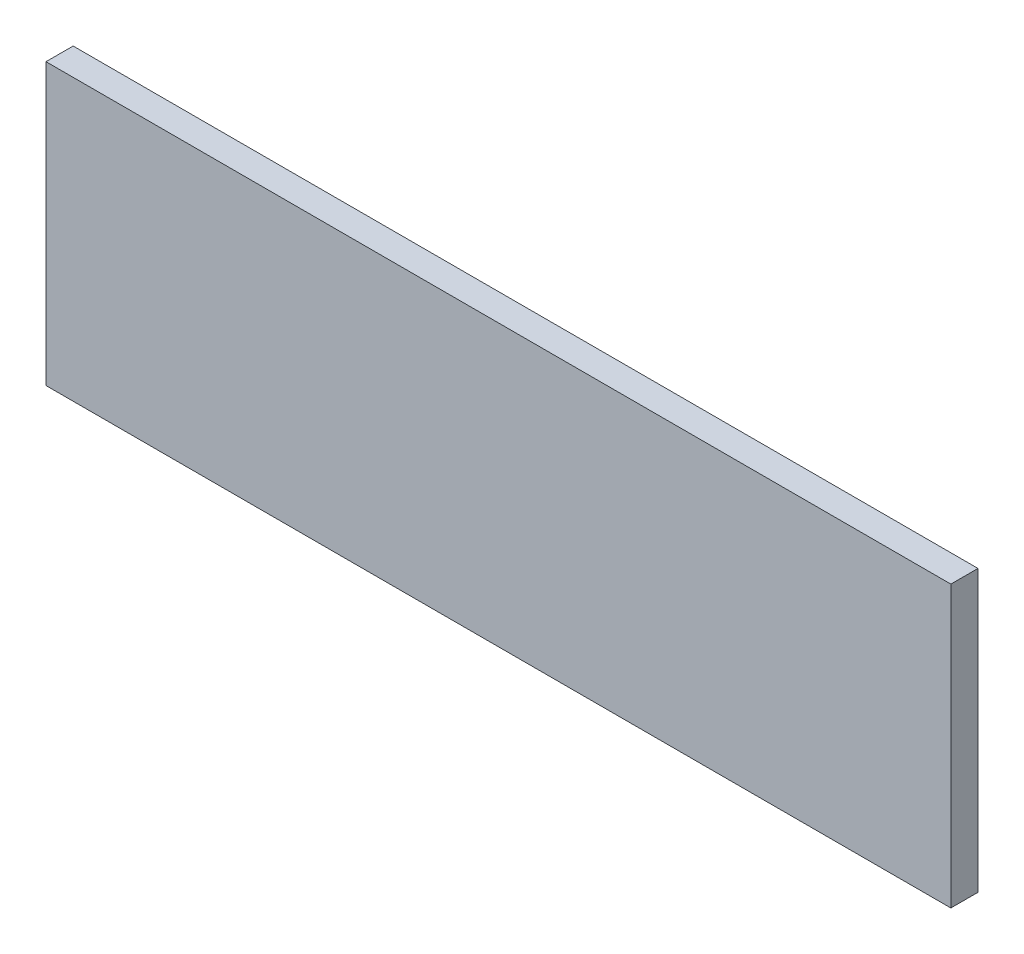
ISO-10303-21;
HEADER;
FILE_DESCRIPTION(('STEP AP214'),'2;1');
FILE_NAME('part.step','',(''),(''),'','','');
FILE_SCHEMA(('AUTOMOTIVE_DESIGN { 1 0 10303 214 1 1 1 1 }'));
ENDSEC;
DATA;
#1=APPLICATION_CONTEXT('core data for automotive mechanical design processes');
#2=APPLICATION_PROTOCOL_DEFINITION('international standard','automotive_design',2000,#1);
#3=PRODUCT_CONTEXT('',#1,'mechanical');
#4=PRODUCT('Part','Part','',(#3));
#5=PRODUCT_RELATED_PRODUCT_CATEGORY('part','',(#4));
#6=PRODUCT_DEFINITION_FORMATION('','',#4);
#7=PRODUCT_DEFINITION_CONTEXT('part definition',#1,'design');
#8=PRODUCT_DEFINITION('design','',#6,#7);
#9=PRODUCT_DEFINITION_SHAPE('','',#8);
#10=(LENGTH_UNIT() NAMED_UNIT(*) SI_UNIT(.MILLI.,.METRE.));
#11=(NAMED_UNIT(*) PLANE_ANGLE_UNIT() SI_UNIT($,.RADIAN.));
#12=(NAMED_UNIT(*) SI_UNIT($,.STERADIAN.) SOLID_ANGLE_UNIT());
#13=UNCERTAINTY_MEASURE_WITH_UNIT(LENGTH_MEASURE(1.E-05),#10,'distance_accuracy_value','');
#14=(GEOMETRIC_REPRESENTATION_CONTEXT(3) GLOBAL_UNCERTAINTY_ASSIGNED_CONTEXT((#13)) GLOBAL_UNIT_ASSIGNED_CONTEXT((#10,
#11,#12)) REPRESENTATION_CONTEXT('',''));
#15=CARTESIAN_POINT('',(0.,0.,0.));
#16=DIRECTION('',(0.,0.,1.));
#17=DIRECTION('',(1.,0.,0.));
#18=AXIS2_PLACEMENT_3D('',#15,#16,#17);
#19=CARTESIAN_POINT('',(50.,15.5,3.));
#20=DIRECTION('',(-1.,0.,0.));
#21=DIRECTION('',(0.,-1.,0.));
#22=AXIS2_PLACEMENT_3D('',#19,#20,#21);
#23=PLANE('',#22);
#24=DIRECTION('',(0.,1.,0.));
#25=VECTOR('',#24,1.);
#26=CARTESIAN_POINT('',(50.,15.5,0.));
#27=LINE('',#26,#25);
#28=CARTESIAN_POINT('',(50.,-15.5,0.));
#29=VERTEX_POINT('',#28);
#30=CARTESIAN_POINT('',(50.,15.5,0.));
#31=VERTEX_POINT('',#30);
#32=EDGE_CURVE('E96',#29,#31,#27,.T.);
#33=ORIENTED_EDGE('',*,*,#32,.T.);
#34=DIRECTION('',(0.,0.,-1.));
#35=VECTOR('',#34,1.);
#36=CARTESIAN_POINT('',(50.,15.5,3.));
#37=LINE('',#36,#35);
#38=CARTESIAN_POINT('',(50.,15.5,3.));
#39=VERTEX_POINT('',#38);
#40=EDGE_CURVE('E11',#39,#31,#37,.T.);
#41=ORIENTED_EDGE('',*,*,#40,.F.);
#42=DIRECTION('',(0.,1.,0.));
#43=VECTOR('',#42,1.);
#44=CARTESIAN_POINT('',(50.,15.5,3.));
#45=LINE('',#44,#43);
#46=CARTESIAN_POINT('',(50.,-15.5,3.));
#47=VERTEX_POINT('',#46);
#48=EDGE_CURVE('E84',#47,#39,#45,.T.);
#49=ORIENTED_EDGE('',*,*,#48,.F.);
#50=DIRECTION('',(0.,0.,-1.));
#51=VECTOR('',#50,1.);
#52=CARTESIAN_POINT('',(50.,-15.5,3.));
#53=LINE('',#52,#51);
#54=EDGE_CURVE('E92',#47,#29,#53,.T.);
#55=ORIENTED_EDGE('',*,*,#54,.T.);
#56=EDGE_LOOP('',(#33,#41,#49,#55));
#57=FACE_BOUND('',#56,.T.);
#58=ADVANCED_FACE('F33',(#57),#23,.F.);
#59=CARTESIAN_POINT('',(-50.,15.5,3.));
#60=DIRECTION('',(0.,-1.,0.));
#61=DIRECTION('',(0.,0.,-1.));
#62=AXIS2_PLACEMENT_3D('',#59,#60,#61);
#63=PLANE('',#62);
#64=DIRECTION('',(-1.,0.,0.));
#65=VECTOR('',#64,1.);
#66=CARTESIAN_POINT('',(-50.,15.5,0.));
#67=LINE('',#66,#65);
#68=CARTESIAN_POINT('',(-50.,15.5,0.));
#69=VERTEX_POINT('',#68);
#70=EDGE_CURVE('E88',#31,#69,#67,.T.);
#71=ORIENTED_EDGE('',*,*,#70,.T.);
#72=DIRECTION('',(0.,0.,-1.));
#73=VECTOR('',#72,1.);
#74=CARTESIAN_POINT('',(-50.,15.5,3.));
#75=LINE('',#74,#73);
#76=CARTESIAN_POINT('',(-50.,15.5,3.));
#77=VERTEX_POINT('',#76);
#78=EDGE_CURVE('E41',#77,#69,#75,.T.);
#79=ORIENTED_EDGE('',*,*,#78,.F.);
#80=DIRECTION('',(-1.,0.,0.));
#81=VECTOR('',#80,1.);
#82=CARTESIAN_POINT('',(-50.,15.5,3.));
#83=LINE('',#82,#81);
#84=EDGE_CURVE('E79',#39,#77,#83,.T.);
#85=ORIENTED_EDGE('',*,*,#84,.F.);
#86=ORIENTED_EDGE('',*,*,#40,.T.);
#87=EDGE_LOOP('',(#71,#79,#85,#86));
#88=FACE_BOUND('',#87,.T.);
#89=ADVANCED_FACE('F87',(#88),#63,.F.);
#90=CARTESIAN_POINT('',(-50.,15.5,3.));
#91=DIRECTION('',(1.,0.,0.));
#92=DIRECTION('',(0.,1.,0.));
#93=AXIS2_PLACEMENT_3D('',#90,#91,#92);
#94=PLANE('',#93);
#95=DIRECTION('',(0.,-1.,0.));
#96=VECTOR('',#95,1.);
#97=CARTESIAN_POINT('',(-50.,15.5,0.));
#98=LINE('',#97,#96);
#99=CARTESIAN_POINT('',(-50.,-15.5,0.));
#100=VERTEX_POINT('',#99);
#101=EDGE_CURVE('E66',#69,#100,#98,.T.);
#102=ORIENTED_EDGE('',*,*,#101,.T.);
#103=DIRECTION('',(0.,0.,-1.));
#104=VECTOR('',#103,1.);
#105=CARTESIAN_POINT('',(-50.,-15.5,3.));
#106=LINE('',#105,#104);
#107=CARTESIAN_POINT('',(-50.,-15.5,3.));
#108=VERTEX_POINT('',#107);
#109=EDGE_CURVE('E89',#108,#100,#106,.T.);
#110=ORIENTED_EDGE('',*,*,#109,.F.);
#111=DIRECTION('',(0.,-1.,0.));
#112=VECTOR('',#111,1.);
#113=CARTESIAN_POINT('',(-50.,15.5,3.));
#114=LINE('',#113,#112);
#115=EDGE_CURVE('E82',#77,#108,#114,.T.);
#116=ORIENTED_EDGE('',*,*,#115,.F.);
#117=ORIENTED_EDGE('',*,*,#78,.T.);
#118=EDGE_LOOP('',(#102,#110,#116,#117));
#119=FACE_BOUND('',#118,.T.);
#120=ADVANCED_FACE('F90',(#119),#94,.F.);
#121=CARTESIAN_POINT('',(-50.,-15.5,3.));
#122=DIRECTION('',(0.,1.,0.));
#123=DIRECTION('',(0.,0.,1.));
#124=AXIS2_PLACEMENT_3D('',#121,#122,#123);
#125=PLANE('',#124);
#126=DIRECTION('',(1.,0.,0.));
#127=VECTOR('',#126,1.);
#128=CARTESIAN_POINT('',(-50.,-15.5,0.));
#129=LINE('',#128,#127);
#130=EDGE_CURVE('E72',#100,#29,#129,.T.);
#131=ORIENTED_EDGE('',*,*,#130,.T.);
#132=ORIENTED_EDGE('',*,*,#54,.F.);
#133=DIRECTION('',(1.,0.,0.));
#134=VECTOR('',#133,1.);
#135=CARTESIAN_POINT('',(-50.,-15.5,3.));
#136=LINE('',#135,#134);
#137=EDGE_CURVE('E49',#108,#47,#136,.T.);
#138=ORIENTED_EDGE('',*,*,#137,.F.);
#139=ORIENTED_EDGE('',*,*,#109,.T.);
#140=EDGE_LOOP('',(#131,#132,#138,#139));
#141=FACE_BOUND('',#140,.T.);
#142=ADVANCED_FACE('F103',(#141),#125,.F.);
#143=CARTESIAN_POINT('',(0.,0.,3.));
#144=DIRECTION('',(0.,0.,1.));
#145=DIRECTION('',(1.,0.,0.));
#146=AXIS2_PLACEMENT_3D('',#143,#144,#145);
#147=PLANE('',#146);
#148=ORIENTED_EDGE('',*,*,#48,.T.);
#149=ORIENTED_EDGE('',*,*,#84,.T.);
#150=ORIENTED_EDGE('',*,*,#115,.T.);
#151=ORIENTED_EDGE('',*,*,#137,.T.);
#152=EDGE_LOOP('',(#148,#149,#150,#151));
#153=FACE_BOUND('',#152,.T.);
#154=ADVANCED_FACE('F80',(#153),#147,.T.);
#155=CARTESIAN_POINT('',(0.,0.,0.));
#156=DIRECTION('',(0.,0.,1.));
#157=DIRECTION('',(1.,0.,0.));
#158=AXIS2_PLACEMENT_3D('',#155,#156,#157);
#159=PLANE('',#158);
#160=ORIENTED_EDGE('',*,*,#32,.F.);
#161=ORIENTED_EDGE('',*,*,#130,.F.);
#162=ORIENTED_EDGE('',*,*,#101,.F.);
#163=ORIENTED_EDGE('',*,*,#70,.F.);
#164=EDGE_LOOP('',(#160,#161,#162,#163));
#165=FACE_BOUND('',#164,.T.);
#166=ADVANCED_FACE('F106',(#165),#159,.F.);
#167=CLOSED_SHELL('',(#58,#89,#120,#142,#154,#166));
#168=MANIFOLD_SOLID_BREP('B2',#167);
#169=ADVANCED_BREP_SHAPE_REPRESENTATION('',(#18,#168),#14);
#170=SHAPE_DEFINITION_REPRESENTATION(#9,#169);
ENDSEC;
END-ISO-10303-21;
